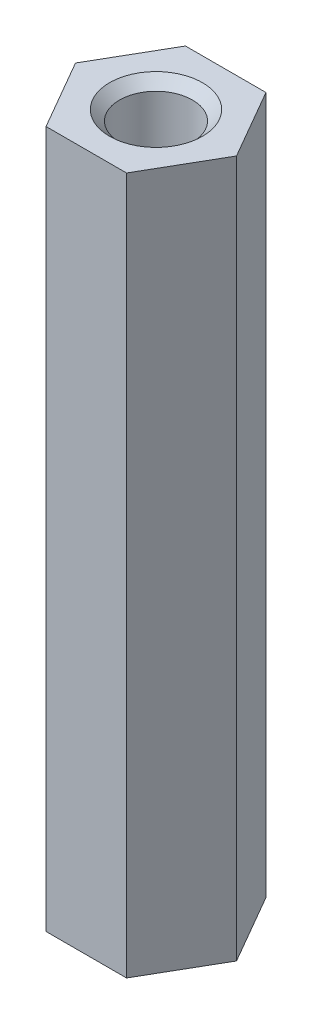
ISO-10303-21;
HEADER;
FILE_DESCRIPTION(('STEP AP214'),'2;1');
FILE_NAME('part.step','',(''),(''),'','','');
FILE_SCHEMA(('AUTOMOTIVE_DESIGN { 1 0 10303 214 1 1 1 1 }'));
ENDSEC;
DATA;
#1=APPLICATION_CONTEXT('core data for automotive mechanical design processes');
#2=APPLICATION_PROTOCOL_DEFINITION('international standard','automotive_design',2000,#1);
#3=PRODUCT_CONTEXT('',#1,'mechanical');
#4=PRODUCT('Part','Part','',(#3));
#5=PRODUCT_RELATED_PRODUCT_CATEGORY('part','',(#4));
#6=PRODUCT_DEFINITION_FORMATION('','',#4);
#7=PRODUCT_DEFINITION_CONTEXT('part definition',#1,'design');
#8=PRODUCT_DEFINITION('design','',#6,#7);
#9=PRODUCT_DEFINITION_SHAPE('','',#8);
#10=(LENGTH_UNIT() NAMED_UNIT(*) SI_UNIT(.MILLI.,.METRE.));
#11=(NAMED_UNIT(*) PLANE_ANGLE_UNIT() SI_UNIT($,.RADIAN.));
#12=(NAMED_UNIT(*) SI_UNIT($,.STERADIAN.) SOLID_ANGLE_UNIT());
#13=UNCERTAINTY_MEASURE_WITH_UNIT(LENGTH_MEASURE(1.E-05),#10,'distance_accuracy_value','');
#14=(GEOMETRIC_REPRESENTATION_CONTEXT(3) GLOBAL_UNCERTAINTY_ASSIGNED_CONTEXT((#13)) GLOBAL_UNIT_ASSIGNED_CONTEXT((#10,
#11,#12)) REPRESENTATION_CONTEXT('',''));
#15=CARTESIAN_POINT('',(0.,0.,0.));
#16=DIRECTION('',(0.,0.,1.));
#17=DIRECTION('',(1.,0.,0.));
#18=AXIS2_PLACEMENT_3D('',#15,#16,#17);
#19=CARTESIAN_POINT('',(0.866025403784438,15.,-1.5));
#20=DIRECTION('',(0.,0.,1.));
#21=DIRECTION('',(1.,0.,0.));
#22=AXIS2_PLACEMENT_3D('',#19,#20,#21);
#23=PLANE('',#22);
#24=DIRECTION('',(0.,1.,0.));
#25=VECTOR('',#24,1.);
#26=CARTESIAN_POINT('',(-0.866025403784439,15.,-1.5));
#27=LINE('',#26,#25);
#28=CARTESIAN_POINT('',(-0.866025403784438,0.,-1.5));
#29=VERTEX_POINT('',#28);
#30=CARTESIAN_POINT('',(-0.866025403784438,15.,-1.5));
#31=VERTEX_POINT('',#30);
#32=EDGE_CURVE('E83',#29,#31,#27,.T.);
#33=ORIENTED_EDGE('',*,*,#32,.T.);
#34=DIRECTION('',(1.,0.,0.));
#35=VECTOR('',#34,1.);
#36=CARTESIAN_POINT('',(0.866025403784438,15.,-1.5));
#37=LINE('',#36,#35);
#38=CARTESIAN_POINT('',(0.866025403784438,15.,-1.5));
#39=VERTEX_POINT('',#38);
#40=EDGE_CURVE('E71',#39,#31,#37,.F.);
#41=ORIENTED_EDGE('',*,*,#40,.F.);
#42=DIRECTION('',(0.,1.,0.));
#43=VECTOR('',#42,1.);
#44=CARTESIAN_POINT('',(0.866025403784438,15.,-1.5));
#45=LINE('',#44,#43);
#46=CARTESIAN_POINT('',(0.866025403784438,0.,-1.5));
#47=VERTEX_POINT('',#46);
#48=EDGE_CURVE('E126',#39,#47,#45,.F.);
#49=ORIENTED_EDGE('',*,*,#48,.T.);
#50=DIRECTION('',(1.,0.,0.));
#51=VECTOR('',#50,1.);
#52=CARTESIAN_POINT('',(0.866025403784438,0.,-1.5));
#53=LINE('',#52,#51);
#54=EDGE_CURVE('E67',#29,#47,#53,.T.);
#55=ORIENTED_EDGE('',*,*,#54,.F.);
#56=EDGE_LOOP('',(#33,#41,#49,#55));
#57=FACE_BOUND('',#56,.T.);
#58=ADVANCED_FACE('F17',(#57),#23,.F.);
#59=CARTESIAN_POINT('',(-0.866025403784439,15.,-1.5));
#60=DIRECTION('',(0.866025403784439,0.,0.5));
#61=DIRECTION('',(0.5,0.,-0.866025403784439));
#62=AXIS2_PLACEMENT_3D('',#59,#60,#61);
#63=PLANE('',#62);
#64=DIRECTION('',(0.,1.,0.));
#65=VECTOR('',#64,1.);
#66=CARTESIAN_POINT('',(-1.73205080756888,15.,0.));
#67=LINE('',#66,#65);
#68=CARTESIAN_POINT('',(-1.73205080756888,0.,0.));
#69=VERTEX_POINT('',#68);
#70=CARTESIAN_POINT('',(-1.73205080756888,15.,0.));
#71=VERTEX_POINT('',#70);
#72=EDGE_CURVE('E86',#69,#71,#67,.T.);
#73=ORIENTED_EDGE('',*,*,#72,.T.);
#74=DIRECTION('',(0.5,0.,-0.866025403784439));
#75=VECTOR('',#74,1.);
#76=CARTESIAN_POINT('',(-0.866025403784439,15.,-1.5));
#77=LINE('',#76,#75);
#78=EDGE_CURVE('E75',#31,#71,#77,.F.);
#79=ORIENTED_EDGE('',*,*,#78,.F.);
#80=ORIENTED_EDGE('',*,*,#32,.F.);
#81=DIRECTION('',(0.5,0.,-0.866025403784439));
#82=VECTOR('',#81,1.);
#83=CARTESIAN_POINT('',(-0.866025403784439,0.,-1.5));
#84=LINE('',#83,#82);
#85=EDGE_CURVE('E87',#69,#29,#84,.T.);
#86=ORIENTED_EDGE('',*,*,#85,.F.);
#87=EDGE_LOOP('',(#73,#79,#80,#86));
#88=FACE_BOUND('',#87,.T.);
#89=ADVANCED_FACE('F82',(#88),#63,.F.);
#90=CARTESIAN_POINT('',(1.7320508075689,15.,0.));
#91=DIRECTION('',(-0.866025403784434,0.,0.500000000000008));
#92=DIRECTION('',(0.500000000000008,0.,0.866025403784434));
#93=AXIS2_PLACEMENT_3D('',#90,#91,#92);
#94=PLANE('',#93);
#95=ORIENTED_EDGE('',*,*,#48,.F.);
#96=DIRECTION('',(0.500000000000008,0.,0.866025403784434));
#97=VECTOR('',#96,1.);
#98=CARTESIAN_POINT('',(1.7320508075689,15.,0.));
#99=LINE('',#98,#97);
#100=CARTESIAN_POINT('',(1.7320508075689,15.,0.));
#101=VERTEX_POINT('',#100);
#102=EDGE_CURVE('E77',#101,#39,#99,.F.);
#103=ORIENTED_EDGE('',*,*,#102,.F.);
#104=DIRECTION('',(0.,1.,0.));
#105=VECTOR('',#104,1.);
#106=CARTESIAN_POINT('',(1.7320508075689,15.,0.));
#107=LINE('',#106,#105);
#108=CARTESIAN_POINT('',(1.7320508075689,0.,0.));
#109=VERTEX_POINT('',#108);
#110=EDGE_CURVE('E113',#101,#109,#107,.F.);
#111=ORIENTED_EDGE('',*,*,#110,.T.);
#112=DIRECTION('',(0.500000000000008,0.,0.866025403784434));
#113=VECTOR('',#112,1.);
#114=CARTESIAN_POINT('',(1.7320508075689,0.,0.));
#115=LINE('',#114,#113);
#116=EDGE_CURVE('E124',#47,#109,#115,.T.);
#117=ORIENTED_EDGE('',*,*,#116,.F.);
#118=EDGE_LOOP('',(#95,#103,#111,#117));
#119=FACE_BOUND('',#118,.T.);
#120=ADVANCED_FACE('F143',(#119),#94,.F.);
#121=CARTESIAN_POINT('',(-1.73205080756888,15.,0.));
#122=DIRECTION('',(0.866025403784439,0.,-0.5));
#123=DIRECTION('',(-0.5,0.,-0.866025403784439));
#124=AXIS2_PLACEMENT_3D('',#121,#122,#123);
#125=PLANE('',#124);
#126=DIRECTION('',(0.,1.,0.));
#127=VECTOR('',#126,1.);
#128=CARTESIAN_POINT('',(-0.866025403784439,15.,1.5));
#129=LINE('',#128,#127);
#130=CARTESIAN_POINT('',(-0.866025403784439,0.,1.5));
#131=VERTEX_POINT('',#130);
#132=CARTESIAN_POINT('',(-0.866025403784439,15.,1.5));
#133=VERTEX_POINT('',#132);
#134=EDGE_CURVE('E112',#131,#133,#129,.T.);
#135=ORIENTED_EDGE('',*,*,#134,.T.);
#136=DIRECTION('',(-0.5,0.,-0.866025403784439));
#137=VECTOR('',#136,1.);
#138=CARTESIAN_POINT('',(-1.73205080756888,15.,0.));
#139=LINE('',#138,#137);
#140=EDGE_CURVE('E35',#71,#133,#139,.F.);
#141=ORIENTED_EDGE('',*,*,#140,.F.);
#142=ORIENTED_EDGE('',*,*,#72,.F.);
#143=DIRECTION('',(-0.5,0.,-0.866025403784439));
#144=VECTOR('',#143,1.);
#145=CARTESIAN_POINT('',(-1.73205080756888,0.,0.));
#146=LINE('',#145,#144);
#147=EDGE_CURVE('E119',#131,#69,#146,.T.);
#148=ORIENTED_EDGE('',*,*,#147,.F.);
#149=EDGE_LOOP('',(#135,#141,#142,#148));
#150=FACE_BOUND('',#149,.T.);
#151=ADVANCED_FACE('F133',(#150),#125,.F.);
#152=CARTESIAN_POINT('',(0.866025403784439,15.,1.5));
#153=DIRECTION('',(-0.866025403784432,0.,-0.500000000000011));
#154=DIRECTION('',(-0.500000000000011,0.,0.866025403784432));
#155=AXIS2_PLACEMENT_3D('',#152,#153,#154);
#156=PLANE('',#155);
#157=ORIENTED_EDGE('',*,*,#110,.F.);
#158=DIRECTION('',(-0.500000000000011,0.,0.866025403784432));
#159=VECTOR('',#158,1.);
#160=CARTESIAN_POINT('',(0.866025403784439,15.,1.5));
#161=LINE('',#160,#159);
#162=CARTESIAN_POINT('',(0.866025403784439,15.,1.5));
#163=VERTEX_POINT('',#162);
#164=EDGE_CURVE('E117',#163,#101,#161,.F.);
#165=ORIENTED_EDGE('',*,*,#164,.F.);
#166=DIRECTION('',(0.,1.,0.));
#167=VECTOR('',#166,1.);
#168=CARTESIAN_POINT('',(0.866025403784439,15.,1.5));
#169=LINE('',#168,#167);
#170=CARTESIAN_POINT('',(0.866025403784439,0.,1.5));
#171=VERTEX_POINT('',#170);
#172=EDGE_CURVE('E109',#163,#171,#169,.F.);
#173=ORIENTED_EDGE('',*,*,#172,.T.);
#174=DIRECTION('',(0.500000000000011,0.,-0.866025403784432));
#175=VECTOR('',#174,1.);
#176=CARTESIAN_POINT('',(0.866025403784439,0.,1.5));
#177=LINE('',#176,#175);
#178=EDGE_CURVE('E101',#171,#109,#177,.T.);
#179=ORIENTED_EDGE('',*,*,#178,.T.);
#180=EDGE_LOOP('',(#157,#165,#173,#179));
#181=FACE_BOUND('',#180,.T.);
#182=ADVANCED_FACE('F141',(#181),#156,.F.);
#183=CARTESIAN_POINT('',(-0.866025403784439,15.,1.5));
#184=DIRECTION('',(0.,0.,-1.));
#185=DIRECTION('',(-1.,0.,0.));
#186=AXIS2_PLACEMENT_3D('',#183,#184,#185);
#187=PLANE('',#186);
#188=ORIENTED_EDGE('',*,*,#172,.F.);
#189=DIRECTION('',(1.,0.,0.));
#190=VECTOR('',#189,1.);
#191=CARTESIAN_POINT('',(0.,15.,1.5));
#192=LINE('',#191,#190);
#193=EDGE_CURVE('E98',#133,#163,#192,.T.);
#194=ORIENTED_EDGE('',*,*,#193,.F.);
#195=ORIENTED_EDGE('',*,*,#134,.F.);
#196=DIRECTION('',(1.,0.,0.));
#197=VECTOR('',#196,1.);
#198=CARTESIAN_POINT('',(0.,0.,1.5));
#199=LINE('',#198,#197);
#200=EDGE_CURVE('E105',#131,#171,#199,.T.);
#201=ORIENTED_EDGE('',*,*,#200,.T.);
#202=EDGE_LOOP('',(#188,#194,#195,#201));
#203=FACE_BOUND('',#202,.T.);
#204=ADVANCED_FACE('F137',(#203),#187,.F.);
#205=CARTESIAN_POINT('',(0.,0.,0.));
#206=DIRECTION('',(0.,1.,0.));
#207=DIRECTION('',(0.,0.,1.));
#208=AXIS2_PLACEMENT_3D('',#205,#206,#207);
#209=PLANE('',#208);
#210=ORIENTED_EDGE('',*,*,#200,.F.);
#211=ORIENTED_EDGE('',*,*,#147,.T.);
#212=ORIENTED_EDGE('',*,*,#85,.T.);
#213=ORIENTED_EDGE('',*,*,#54,.T.);
#214=ORIENTED_EDGE('',*,*,#116,.T.);
#215=ORIENTED_EDGE('',*,*,#178,.F.);
#216=EDGE_LOOP('',(#210,#211,#212,#213,#214,#215));
#217=FACE_BOUND('',#216,.T.);
#218=CARTESIAN_POINT('',(0.,0.,0.));
#219=DIRECTION('',(0.,-1.,0.));
#220=DIRECTION('',(0.,0.,-1.));
#221=AXIS2_PLACEMENT_3D('',#218,#219,#220);
#222=CIRCLE('',#221,1.0000000000332);
#223=CARTESIAN_POINT('',(0.,0.,-1.0000000000332));
#224=VERTEX_POINT('',#223);
#225=EDGE_CURVE('E20',#224,#224,#222,.F.);
#226=ORIENTED_EDGE('',*,*,#225,.T.);
#227=EDGE_LOOP('',(#226));
#228=FACE_BOUND('',#227,.T.);
#229=ADVANCED_FACE('F130',(#217,#228),#209,.F.);
#230=CARTESIAN_POINT('',(0.,15.,0.));
#231=DIRECTION('',(0.,1.,0.));
#232=DIRECTION('',(0.,0.,1.));
#233=AXIS2_PLACEMENT_3D('',#230,#231,#232);
#234=PLANE('',#233);
#235=ORIENTED_EDGE('',*,*,#140,.T.);
#236=ORIENTED_EDGE('',*,*,#193,.T.);
#237=ORIENTED_EDGE('',*,*,#164,.T.);
#238=ORIENTED_EDGE('',*,*,#102,.T.);
#239=ORIENTED_EDGE('',*,*,#40,.T.);
#240=ORIENTED_EDGE('',*,*,#78,.T.);
#241=EDGE_LOOP('',(#235,#236,#237,#238,#239,#240));
#242=FACE_BOUND('',#241,.T.);
#243=CARTESIAN_POINT('',(0.,14.9999999999864,0.));
#244=DIRECTION('',(0.,1.,0.));
#245=DIRECTION('',(0.,0.,1.));
#246=AXIS2_PLACEMENT_3D('',#243,#244,#245);
#247=CIRCLE('',#246,0.999999999976353);
#248=CARTESIAN_POINT('',(0.,14.9999999999864,0.999999999976353));
#249=VERTEX_POINT('',#248);
#250=EDGE_CURVE('E92',#249,#249,#247,.F.);
#251=ORIENTED_EDGE('',*,*,#250,.T.);
#252=EDGE_LOOP('',(#251));
#253=FACE_BOUND('',#252,.T.);
#254=ADVANCED_FACE('F73',(#242,#253),#234,.T.);
#255=CARTESIAN_POINT('',(0.,1.13686837721616E-10,0.));
#256=DIRECTION('',(0.,-1.,0.));
#257=DIRECTION('',(0.,0.,-1.));
#258=AXIS2_PLACEMENT_3D('',#255,#256,#257);
#259=CONICAL_SURFACE('',#258,0.99999999991951,0.785398163397448);
#260=ORIENTED_EDGE('',*,*,#225,.F.);
#261=EDGE_LOOP('',(#260));
#262=FACE_BOUND('',#261,.T.);
#263=CARTESIAN_POINT('',(0.,0.215000000000002,0.));
#264=DIRECTION('',(0.,-1.,0.));
#265=DIRECTION('',(0.,0.,-1.));
#266=AXIS2_PLACEMENT_3D('',#263,#264,#265);
#267=CIRCLE('',#266,0.785);
#268=CARTESIAN_POINT('',(0.,0.215000000000002,-0.785));
#269=VERTEX_POINT('',#268);
#270=EDGE_CURVE('E26',#269,#269,#267,.F.);
#271=ORIENTED_EDGE('',*,*,#270,.T.);
#272=EDGE_LOOP('',(#271));
#273=FACE_BOUND('',#272,.T.);
#274=ADVANCED_FACE('F160',(#262,#273),#259,.F.);
#275=CARTESIAN_POINT('',(0.,14.9999999999864,0.));
#276=DIRECTION('',(0.,1.,0.));
#277=DIRECTION('',(0.,0.,1.));
#278=AXIS2_PLACEMENT_3D('',#275,#276,#277);
#279=CONICAL_SURFACE('',#278,0.999999999976353,0.785398163397448);
#280=CARTESIAN_POINT('',(0.,14.785,0.));
#281=DIRECTION('',(0.,-1.,0.));
#282=DIRECTION('',(0.,0.,-1.));
#283=AXIS2_PLACEMENT_3D('',#280,#281,#282);
#284=CIRCLE('',#283,0.785);
#285=CARTESIAN_POINT('',(0.,14.785,-0.785));
#286=VERTEX_POINT('',#285);
#287=EDGE_CURVE('E11',#286,#286,#284,.T.);
#288=ORIENTED_EDGE('',*,*,#287,.T.);
#289=EDGE_LOOP('',(#288));
#290=FACE_BOUND('',#289,.T.);
#291=ORIENTED_EDGE('',*,*,#250,.F.);
#292=EDGE_LOOP('',(#291));
#293=FACE_BOUND('',#292,.T.);
#294=ADVANCED_FACE('F154',(#290,#293),#279,.F.);
#295=CARTESIAN_POINT('',(0.,15.,0.));
#296=DIRECTION('',(0.,-1.,0.));
#297=DIRECTION('',(0.,0.,-1.));
#298=AXIS2_PLACEMENT_3D('',#295,#296,#297);
#299=CYLINDRICAL_SURFACE('',#298,0.785);
#300=ORIENTED_EDGE('',*,*,#270,.F.);
#301=EDGE_LOOP('',(#300));
#302=FACE_BOUND('',#301,.T.);
#303=ORIENTED_EDGE('',*,*,#287,.F.);
#304=EDGE_LOOP('',(#303));
#305=FACE_BOUND('',#304,.T.);
#306=ADVANCED_FACE('F152',(#302,#305),#299,.F.);
#307=CLOSED_SHELL('',(#58,#89,#120,#151,#182,#204,#229,#254,#274,#294,#306));
#308=MANIFOLD_SOLID_BREP('B1',#307);
#309=ADVANCED_BREP_SHAPE_REPRESENTATION('',(#18,#308),#14);
#310=SHAPE_DEFINITION_REPRESENTATION(#9,#309);
ENDSEC;
END-ISO-10303-21;
